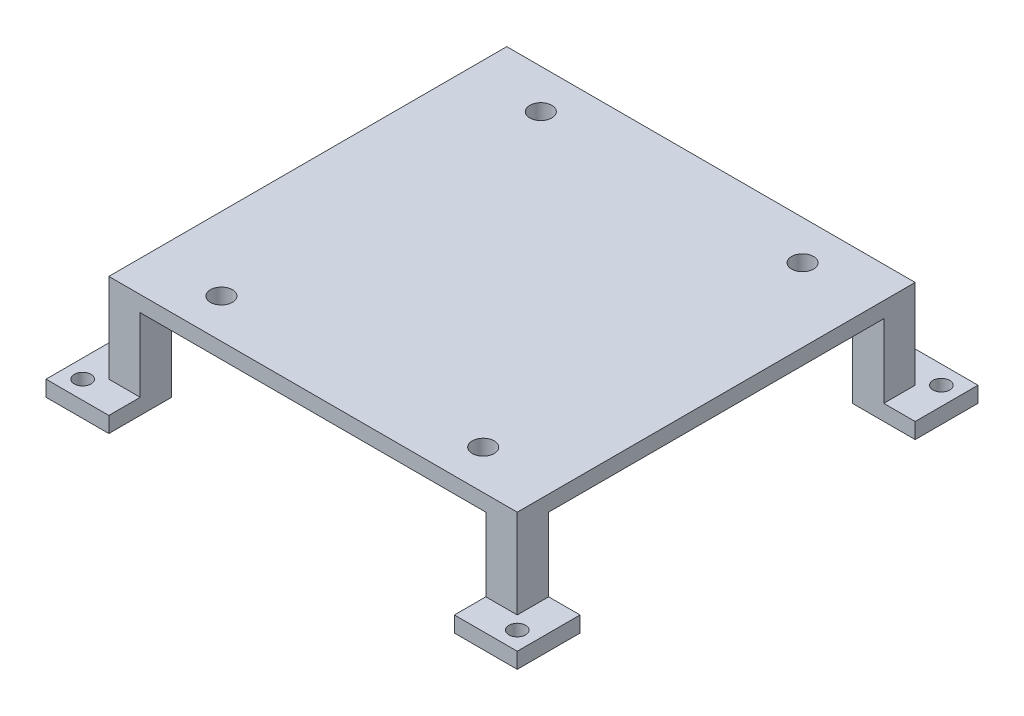
ISO-10303-21;
HEADER;
FILE_DESCRIPTION(('STEP AP214'),'2;1');
FILE_NAME('part.step','',(''),(''),'','','');
FILE_SCHEMA(('AUTOMOTIVE_DESIGN { 1 0 10303 214 1 1 1 1 }'));
ENDSEC;
DATA;
#1=APPLICATION_CONTEXT('core data for automotive mechanical design processes');
#2=APPLICATION_PROTOCOL_DEFINITION('international standard','automotive_design',2000,#1);
#3=PRODUCT_CONTEXT('',#1,'mechanical');
#4=PRODUCT('Part','Part','',(#3));
#5=PRODUCT_RELATED_PRODUCT_CATEGORY('part','',(#4));
#6=PRODUCT_DEFINITION_FORMATION('','',#4);
#7=PRODUCT_DEFINITION_CONTEXT('part definition',#1,'design');
#8=PRODUCT_DEFINITION('design','',#6,#7);
#9=PRODUCT_DEFINITION_SHAPE('','',#8);
#10=(LENGTH_UNIT() NAMED_UNIT(*) SI_UNIT(.MILLI.,.METRE.));
#11=(NAMED_UNIT(*) PLANE_ANGLE_UNIT() SI_UNIT($,.RADIAN.));
#12=(NAMED_UNIT(*) SI_UNIT($,.STERADIAN.) SOLID_ANGLE_UNIT());
#13=UNCERTAINTY_MEASURE_WITH_UNIT(LENGTH_MEASURE(1.E-05),#10,'distance_accuracy_value','');
#14=(GEOMETRIC_REPRESENTATION_CONTEXT(3) GLOBAL_UNCERTAINTY_ASSIGNED_CONTEXT((#13)) GLOBAL_UNIT_ASSIGNED_CONTEXT((#10,
#11,#12)) REPRESENTATION_CONTEXT('',''));
#15=CARTESIAN_POINT('',(0.,0.,0.));
#16=DIRECTION('',(0.,0.,1.));
#17=DIRECTION('',(1.,0.,0.));
#18=AXIS2_PLACEMENT_3D('',#15,#16,#17);
#19=CARTESIAN_POINT('',(0.,17.,0.));
#20=DIRECTION('',(0.,1.,0.));
#21=DIRECTION('',(0.,0.,1.));
#22=AXIS2_PLACEMENT_3D('',#19,#20,#21);
#23=PLANE('',#22);
#24=CARTESIAN_POINT('',(25.,17.,30.5));
#25=DIRECTION('',(0.,1.,0.));
#26=DIRECTION('',(0.,0.,1.));
#27=AXIS2_PLACEMENT_3D('',#24,#25,#26);
#28=CIRCLE('',#27,2.1);
#29=CARTESIAN_POINT('',(25.,17.,32.6));
#30=VERTEX_POINT('',#29);
#31=EDGE_CURVE('E519',#30,#30,#28,.F.);
#32=ORIENTED_EDGE('',*,*,#31,.F.);
#33=EDGE_LOOP('',(#32));
#34=FACE_BOUND('',#33,.T.);
#35=CARTESIAN_POINT('',(-25.,17.,-30.5));
#36=DIRECTION('',(0.,1.,0.));
#37=DIRECTION('',(0.,0.,1.));
#38=AXIS2_PLACEMENT_3D('',#35,#36,#37);
#39=CIRCLE('',#38,2.1);
#40=CARTESIAN_POINT('',(-25.,17.,-28.4));
#41=VERTEX_POINT('',#40);
#42=EDGE_CURVE('E527',#41,#41,#39,.F.);
#43=ORIENTED_EDGE('',*,*,#42,.F.);
#44=EDGE_LOOP('',(#43));
#45=FACE_BOUND('',#44,.T.);
#46=CARTESIAN_POINT('',(-25.,17.,30.5));
#47=DIRECTION('',(0.,1.,0.));
#48=DIRECTION('',(0.,0.,1.));
#49=AXIS2_PLACEMENT_3D('',#46,#47,#48);
#50=CIRCLE('',#49,2.1);
#51=CARTESIAN_POINT('',(-25.,17.,32.6));
#52=VERTEX_POINT('',#51);
#53=EDGE_CURVE('E520',#52,#52,#50,.F.);
#54=ORIENTED_EDGE('',*,*,#53,.F.);
#55=EDGE_LOOP('',(#54));
#56=FACE_BOUND('',#55,.T.);
#57=CARTESIAN_POINT('',(25.,17.,-30.5));
#58=DIRECTION('',(0.,1.,0.));
#59=DIRECTION('',(0.,0.,1.));
#60=AXIS2_PLACEMENT_3D('',#57,#58,#59);
#61=CIRCLE('',#60,2.1);
#62=CARTESIAN_POINT('',(25.,17.,-28.4));
#63=VERTEX_POINT('',#62);
#64=EDGE_CURVE('E506',#63,#63,#61,.F.);
#65=ORIENTED_EDGE('',*,*,#64,.F.);
#66=EDGE_LOOP('',(#65));
#67=FACE_BOUND('',#66,.T.);
#68=DIRECTION('',(-1.,0.,0.));
#69=VECTOR('',#68,1.);
#70=CARTESIAN_POINT('',(33.,17.,32.));
#71=LINE('',#70,#69);
#72=CARTESIAN_POINT('',(39.,17.,32.));
#73=VERTEX_POINT('',#72);
#74=CARTESIAN_POINT('',(33.,17.,32.));
#75=VERTEX_POINT('',#74);
#76=EDGE_CURVE('E62',#73,#75,#71,.T.);
#77=ORIENTED_EDGE('',*,*,#76,.T.);
#78=DIRECTION('',(0.,0.,1.));
#79=VECTOR('',#78,1.);
#80=CARTESIAN_POINT('',(33.,17.,38.));
#81=LINE('',#80,#79);
#82=CARTESIAN_POINT('',(33.,17.,38.));
#83=VERTEX_POINT('',#82);
#84=EDGE_CURVE('E239',#75,#83,#81,.T.);
#85=ORIENTED_EDGE('',*,*,#84,.T.);
#86=DIRECTION('',(1.,0.,0.));
#87=VECTOR('',#86,1.);
#88=CARTESIAN_POINT('',(-39.,17.,38.));
#89=LINE('',#88,#87);
#90=CARTESIAN_POINT('',(-33.,17.,38.));
#91=VERTEX_POINT('',#90);
#92=EDGE_CURVE('E250',#91,#83,#89,.T.);
#93=ORIENTED_EDGE('',*,*,#92,.F.);
#94=DIRECTION('',(0.,0.,-1.));
#95=VECTOR('',#94,1.);
#96=CARTESIAN_POINT('',(-33.,17.,32.));
#97=LINE('',#96,#95);
#98=CARTESIAN_POINT('',(-33.,17.,32.));
#99=VERTEX_POINT('',#98);
#100=EDGE_CURVE('E70',#91,#99,#97,.T.);
#101=ORIENTED_EDGE('',*,*,#100,.T.);
#102=DIRECTION('',(-1.,0.,0.));
#103=VECTOR('',#102,1.);
#104=CARTESIAN_POINT('',(-39.,17.,32.));
#105=LINE('',#104,#103);
#106=CARTESIAN_POINT('',(-39.,17.,32.));
#107=VERTEX_POINT('',#106);
#108=EDGE_CURVE('E406',#99,#107,#105,.T.);
#109=ORIENTED_EDGE('',*,*,#108,.T.);
#110=DIRECTION('',(0.,0.,1.));
#111=VECTOR('',#110,1.);
#112=CARTESIAN_POINT('',(-39.,17.,-38.));
#113=LINE('',#112,#111);
#114=CARTESIAN_POINT('',(-39.,17.,-32.));
#115=VERTEX_POINT('',#114);
#116=EDGE_CURVE('E258',#115,#107,#113,.T.);
#117=ORIENTED_EDGE('',*,*,#116,.F.);
#118=DIRECTION('',(1.,0.,0.));
#119=VECTOR('',#118,1.);
#120=CARTESIAN_POINT('',(-33.,17.,-32.));
#121=LINE('',#120,#119);
#122=CARTESIAN_POINT('',(-33.,17.,-32.));
#123=VERTEX_POINT('',#122);
#124=EDGE_CURVE('E280',#115,#123,#121,.T.);
#125=ORIENTED_EDGE('',*,*,#124,.T.);
#126=DIRECTION('',(0.,0.,-1.));
#127=VECTOR('',#126,1.);
#128=CARTESIAN_POINT('',(-33.,17.,-38.));
#129=LINE('',#128,#127);
#130=CARTESIAN_POINT('',(-33.,17.,-38.));
#131=VERTEX_POINT('',#130);
#132=EDGE_CURVE('E277',#123,#131,#129,.T.);
#133=ORIENTED_EDGE('',*,*,#132,.T.);
#134=DIRECTION('',(-1.,0.,0.));
#135=VECTOR('',#134,1.);
#136=CARTESIAN_POINT('',(-39.,17.,-38.));
#137=LINE('',#136,#135);
#138=CARTESIAN_POINT('',(33.,17.,-38.));
#139=VERTEX_POINT('',#138);
#140=EDGE_CURVE('E260',#139,#131,#137,.T.);
#141=ORIENTED_EDGE('',*,*,#140,.F.);
#142=DIRECTION('',(0.,0.,1.));
#143=VECTOR('',#142,1.);
#144=CARTESIAN_POINT('',(33.,17.,-38.));
#145=LINE('',#144,#143);
#146=CARTESIAN_POINT('',(33.,17.,-32.));
#147=VERTEX_POINT('',#146);
#148=EDGE_CURVE('E352',#139,#147,#145,.T.);
#149=ORIENTED_EDGE('',*,*,#148,.T.);
#150=DIRECTION('',(1.,0.,0.));
#151=VECTOR('',#150,1.);
#152=CARTESIAN_POINT('',(33.,17.,-32.));
#153=LINE('',#152,#151);
#154=CARTESIAN_POINT('',(39.,17.,-32.));
#155=VERTEX_POINT('',#154);
#156=EDGE_CURVE('E448',#147,#155,#153,.T.);
#157=ORIENTED_EDGE('',*,*,#156,.T.);
#158=DIRECTION('',(0.,0.,-1.));
#159=VECTOR('',#158,1.);
#160=CARTESIAN_POINT('',(39.,17.,-38.));
#161=LINE('',#160,#159);
#162=EDGE_CURVE('E257',#73,#155,#161,.T.);
#163=ORIENTED_EDGE('',*,*,#162,.F.);
#164=EDGE_LOOP('',(#77,#85,#93,#101,#109,#117,#125,#133,#141,#149,#157,#163));
#165=FACE_BOUND('',#164,.T.);
#166=ADVANCED_FACE('F47',(#34,#45,#56,#67,#165),#23,.F.);
#167=CARTESIAN_POINT('',(-45.,3.,-44.));
#168=DIRECTION('',(1.,0.,0.));
#169=DIRECTION('',(0.,0.,-1.));
#170=AXIS2_PLACEMENT_3D('',#167,#168,#169);
#171=PLANE('',#170);
#172=DIRECTION('',(0.,0.,1.));
#173=VECTOR('',#172,1.);
#174=CARTESIAN_POINT('',(-45.,0.,-44.));
#175=LINE('',#174,#173);
#176=CARTESIAN_POINT('',(-45.,0.,-44.));
#177=VERTEX_POINT('',#176);
#178=CARTESIAN_POINT('',(-45.,0.,-32.));
#179=VERTEX_POINT('',#178);
#180=EDGE_CURVE('E297',#177,#179,#175,.T.);
#181=ORIENTED_EDGE('',*,*,#180,.T.);
#182=DIRECTION('',(0.,-1.,0.));
#183=VECTOR('',#182,1.);
#184=CARTESIAN_POINT('',(-45.,3.,-32.));
#185=LINE('',#184,#183);
#186=CARTESIAN_POINT('',(-45.,3.,-32.));
#187=VERTEX_POINT('',#186);
#188=EDGE_CURVE('E13',#187,#179,#185,.T.);
#189=ORIENTED_EDGE('',*,*,#188,.F.);
#190=DIRECTION('',(0.,0.,1.));
#191=VECTOR('',#190,1.);
#192=CARTESIAN_POINT('',(-45.,3.,-44.));
#193=LINE('',#192,#191);
#194=CARTESIAN_POINT('',(-45.,3.,-44.));
#195=VERTEX_POINT('',#194);
#196=EDGE_CURVE('E298',#195,#187,#193,.T.);
#197=ORIENTED_EDGE('',*,*,#196,.F.);
#198=DIRECTION('',(0.,-1.,0.));
#199=VECTOR('',#198,1.);
#200=CARTESIAN_POINT('',(-45.,3.,-44.));
#201=LINE('',#200,#199);
#202=EDGE_CURVE('E308',#195,#177,#201,.T.);
#203=ORIENTED_EDGE('',*,*,#202,.T.);
#204=EDGE_LOOP('',(#181,#189,#197,#203));
#205=FACE_BOUND('',#204,.T.);
#206=ADVANCED_FACE('F49',(#205),#171,.F.);
#207=CARTESIAN_POINT('',(-45.,3.,-32.));
#208=DIRECTION('',(0.,0.,-1.));
#209=DIRECTION('',(-1.,0.,0.));
#210=AXIS2_PLACEMENT_3D('',#207,#208,#209);
#211=PLANE('',#210);
#212=DIRECTION('',(1.,0.,0.));
#213=VECTOR('',#212,1.);
#214=CARTESIAN_POINT('',(-45.,0.,-32.));
#215=LINE('',#214,#213);
#216=CARTESIAN_POINT('',(-33.,0.,-32.));
#217=VERTEX_POINT('',#216);
#218=EDGE_CURVE('E311',#179,#217,#215,.T.);
#219=ORIENTED_EDGE('',*,*,#218,.T.);
#220=DIRECTION('',(0.,-1.,0.));
#221=VECTOR('',#220,1.);
#222=CARTESIAN_POINT('',(-33.,3.,-32.));
#223=LINE('',#222,#221);
#224=EDGE_CURVE('E55',#123,#217,#223,.T.);
#225=ORIENTED_EDGE('',*,*,#224,.F.);
#226=ORIENTED_EDGE('',*,*,#124,.F.);
#227=DIRECTION('',(0.,-1.,0.));
#228=VECTOR('',#227,1.);
#229=CARTESIAN_POINT('',(-39.,17.,-32.));
#230=LINE('',#229,#228);
#231=CARTESIAN_POINT('',(-39.,3.,-32.));
#232=VERTEX_POINT('',#231);
#233=EDGE_CURVE('E284',#115,#232,#230,.T.);
#234=ORIENTED_EDGE('',*,*,#233,.T.);
#235=DIRECTION('',(1.,0.,0.));
#236=VECTOR('',#235,1.);
#237=CARTESIAN_POINT('',(-45.,3.,-32.));
#238=LINE('',#237,#236);
#239=EDGE_CURVE('E301',#187,#232,#238,.T.);
#240=ORIENTED_EDGE('',*,*,#239,.F.);
#241=ORIENTED_EDGE('',*,*,#188,.T.);
#242=EDGE_LOOP('',(#219,#225,#226,#234,#240,#241));
#243=FACE_BOUND('',#242,.T.);
#244=ADVANCED_FACE('F355',(#243),#211,.F.);
#245=CARTESIAN_POINT('',(-33.,3.,-44.));
#246=DIRECTION('',(-1.,0.,0.));
#247=DIRECTION('',(0.,0.,1.));
#248=AXIS2_PLACEMENT_3D('',#245,#246,#247);
#249=PLANE('',#248);
#250=DIRECTION('',(0.,0.,-1.));
#251=VECTOR('',#250,1.);
#252=CARTESIAN_POINT('',(-33.,0.,-44.));
#253=LINE('',#252,#251);
#254=CARTESIAN_POINT('',(-33.,0.,-44.));
#255=VERTEX_POINT('',#254);
#256=EDGE_CURVE('E313',#217,#255,#253,.T.);
#257=ORIENTED_EDGE('',*,*,#256,.T.);
#258=DIRECTION('',(0.,-1.,0.));
#259=VECTOR('',#258,1.);
#260=CARTESIAN_POINT('',(-33.,3.,-44.));
#261=LINE('',#260,#259);
#262=CARTESIAN_POINT('',(-33.,3.,-44.));
#263=VERTEX_POINT('',#262);
#264=EDGE_CURVE('E318',#263,#255,#261,.T.);
#265=ORIENTED_EDGE('',*,*,#264,.F.);
#266=DIRECTION('',(0.,0.,-1.));
#267=VECTOR('',#266,1.);
#268=CARTESIAN_POINT('',(-33.,3.,-44.));
#269=LINE('',#268,#267);
#270=CARTESIAN_POINT('',(-33.,3.,-38.));
#271=VERTEX_POINT('',#270);
#272=EDGE_CURVE('E304',#271,#263,#269,.T.);
#273=ORIENTED_EDGE('',*,*,#272,.F.);
#274=DIRECTION('',(0.,-1.,0.));
#275=VECTOR('',#274,1.);
#276=CARTESIAN_POINT('',(-33.,17.,-38.));
#277=LINE('',#276,#275);
#278=EDGE_CURVE('E294',#131,#271,#277,.T.);
#279=ORIENTED_EDGE('',*,*,#278,.F.);
#280=ORIENTED_EDGE('',*,*,#132,.F.);
#281=ORIENTED_EDGE('',*,*,#224,.T.);
#282=EDGE_LOOP('',(#257,#265,#273,#279,#280,#281));
#283=FACE_BOUND('',#282,.T.);
#284=ADVANCED_FACE('F324',(#283),#249,.F.);
#285=CARTESIAN_POINT('',(-45.,3.,-44.));
#286=DIRECTION('',(0.,0.,1.));
#287=DIRECTION('',(1.,0.,0.));
#288=AXIS2_PLACEMENT_3D('',#285,#286,#287);
#289=PLANE('',#288);
#290=DIRECTION('',(-1.,0.,0.));
#291=VECTOR('',#290,1.);
#292=CARTESIAN_POINT('',(-45.,0.,-44.));
#293=LINE('',#292,#291);
#294=EDGE_CURVE('E302',#255,#177,#293,.T.);
#295=ORIENTED_EDGE('',*,*,#294,.T.);
#296=ORIENTED_EDGE('',*,*,#202,.F.);
#297=DIRECTION('',(-1.,0.,0.));
#298=VECTOR('',#297,1.);
#299=CARTESIAN_POINT('',(-45.,3.,-44.));
#300=LINE('',#299,#298);
#301=EDGE_CURVE('E306',#263,#195,#300,.T.);
#302=ORIENTED_EDGE('',*,*,#301,.F.);
#303=ORIENTED_EDGE('',*,*,#264,.T.);
#304=EDGE_LOOP('',(#295,#296,#302,#303));
#305=FACE_BOUND('',#304,.T.);
#306=ADVANCED_FACE('F335',(#305),#289,.F.);
#307=CARTESIAN_POINT('',(0.,3.,0.));
#308=DIRECTION('',(0.,1.,0.));
#309=DIRECTION('',(0.,0.,1.));
#310=AXIS2_PLACEMENT_3D('',#307,#308,#309);
#311=PLANE('',#310);
#312=CARTESIAN_POINT('',(-41.5,3.,-40.5));
#313=DIRECTION('',(0.,1.,0.));
#314=DIRECTION('',(0.,0.,-1.));
#315=AXIS2_PLACEMENT_3D('',#312,#313,#314);
#316=CIRCLE('',#315,1.6);
#317=CARTESIAN_POINT('',(-41.5,3.,-42.1));
#318=VERTEX_POINT('',#317);
#319=EDGE_CURVE('E498',#318,#318,#316,.T.);
#320=ORIENTED_EDGE('',*,*,#319,.F.);
#321=EDGE_LOOP('',(#320));
#322=FACE_BOUND('',#321,.T.);
#323=DIRECTION('',(0.,0.,1.));
#324=VECTOR('',#323,1.);
#325=CARTESIAN_POINT('',(-39.,3.,-38.));
#326=LINE('',#325,#324);
#327=CARTESIAN_POINT('',(-39.,3.,-38.));
#328=VERTEX_POINT('',#327);
#329=EDGE_CURVE('E281',#328,#232,#326,.T.);
#330=ORIENTED_EDGE('',*,*,#329,.F.);
#331=DIRECTION('',(-1.,0.,0.));
#332=VECTOR('',#331,1.);
#333=CARTESIAN_POINT('',(-33.,3.,-38.));
#334=LINE('',#333,#332);
#335=EDGE_CURVE('E276',#271,#328,#334,.T.);
#336=ORIENTED_EDGE('',*,*,#335,.F.);
#337=ORIENTED_EDGE('',*,*,#272,.T.);
#338=ORIENTED_EDGE('',*,*,#301,.T.);
#339=ORIENTED_EDGE('',*,*,#196,.T.);
#340=ORIENTED_EDGE('',*,*,#239,.T.);
#341=EDGE_LOOP('',(#330,#336,#337,#338,#339,#340));
#342=FACE_BOUND('',#341,.T.);
#343=ADVANCED_FACE('F341',(#322,#342),#311,.T.);
#344=CARTESIAN_POINT('',(0.,0.,0.));
#345=DIRECTION('',(0.,1.,0.));
#346=DIRECTION('',(0.,0.,1.));
#347=AXIS2_PLACEMENT_3D('',#344,#345,#346);
#348=PLANE('',#347);
#349=CARTESIAN_POINT('',(-41.5,0.,-40.5));
#350=DIRECTION('',(0.,1.,0.));
#351=DIRECTION('',(0.,0.,1.));
#352=AXIS2_PLACEMENT_3D('',#349,#350,#351);
#353=CIRCLE('',#352,1.6);
#354=CARTESIAN_POINT('',(-41.5,0.,-38.9));
#355=VERTEX_POINT('',#354);
#356=EDGE_CURVE('E493',#355,#355,#353,.F.);
#357=ORIENTED_EDGE('',*,*,#356,.F.);
#358=EDGE_LOOP('',(#357));
#359=FACE_BOUND('',#358,.T.);
#360=ORIENTED_EDGE('',*,*,#180,.F.);
#361=ORIENTED_EDGE('',*,*,#294,.F.);
#362=ORIENTED_EDGE('',*,*,#256,.F.);
#363=ORIENTED_EDGE('',*,*,#218,.F.);
#364=EDGE_LOOP('',(#360,#361,#362,#363));
#365=FACE_BOUND('',#364,.T.);
#366=ADVANCED_FACE('F332',(#359,#365),#348,.F.);
#367=CARTESIAN_POINT('',(-33.,17.,-38.));
#368=DIRECTION('',(0.,0.,1.));
#369=DIRECTION('',(1.,0.,0.));
#370=AXIS2_PLACEMENT_3D('',#367,#368,#369);
#371=PLANE('',#370);
#372=ORIENTED_EDGE('',*,*,#335,.T.);
#373=DIRECTION('',(0.,-1.,0.));
#374=VECTOR('',#373,1.);
#375=CARTESIAN_POINT('',(-39.,17.,-38.));
#376=LINE('',#375,#374);
#377=CARTESIAN_POINT('',(-39.,20.,-38.));
#378=VERTEX_POINT('',#377);
#379=EDGE_CURVE('E291',#378,#328,#376,.T.);
#380=ORIENTED_EDGE('',*,*,#379,.F.);
#381=DIRECTION('',(-1.,0.,0.));
#382=VECTOR('',#381,1.);
#383=CARTESIAN_POINT('',(-39.,20.,-38.));
#384=LINE('',#383,#382);
#385=CARTESIAN_POINT('',(39.,20.,-38.));
#386=VERTEX_POINT('',#385);
#387=EDGE_CURVE('E272',#386,#378,#384,.T.);
#388=ORIENTED_EDGE('',*,*,#387,.F.);
#389=DIRECTION('',(0.,-1.,0.));
#390=VECTOR('',#389,1.);
#391=CARTESIAN_POINT('',(39.,20.,-38.));
#392=LINE('',#391,#390);
#393=CARTESIAN_POINT('',(39.,3.,-38.));
#394=VERTEX_POINT('',#393);
#395=EDGE_CURVE('E269',#386,#394,#392,.T.);
#396=ORIENTED_EDGE('',*,*,#395,.T.);
#397=DIRECTION('',(-1.,0.,0.));
#398=VECTOR('',#397,1.);
#399=CARTESIAN_POINT('',(33.,3.,-38.));
#400=LINE('',#399,#398);
#401=CARTESIAN_POINT('',(33.,3.,-38.));
#402=VERTEX_POINT('',#401);
#403=EDGE_CURVE('E449',#394,#402,#400,.T.);
#404=ORIENTED_EDGE('',*,*,#403,.T.);
#405=DIRECTION('',(0.,-1.,0.));
#406=VECTOR('',#405,1.);
#407=CARTESIAN_POINT('',(33.,17.,-38.));
#408=LINE('',#407,#406);
#409=EDGE_CURVE('E348',#139,#402,#408,.T.);
#410=ORIENTED_EDGE('',*,*,#409,.F.);
#411=ORIENTED_EDGE('',*,*,#140,.T.);
#412=ORIENTED_EDGE('',*,*,#278,.T.);
#413=EDGE_LOOP('',(#372,#380,#388,#396,#404,#410,#411,#412));
#414=FACE_BOUND('',#413,.T.);
#415=ADVANCED_FACE('F344',(#414),#371,.F.);
#416=CARTESIAN_POINT('',(-39.,17.,-38.));
#417=DIRECTION('',(1.,0.,0.));
#418=DIRECTION('',(0.,0.,-1.));
#419=AXIS2_PLACEMENT_3D('',#416,#417,#418);
#420=PLANE('',#419);
#421=ORIENTED_EDGE('',*,*,#329,.T.);
#422=ORIENTED_EDGE('',*,*,#233,.F.);
#423=ORIENTED_EDGE('',*,*,#116,.T.);
#424=DIRECTION('',(0.,-1.,0.));
#425=VECTOR('',#424,1.);
#426=CARTESIAN_POINT('',(-39.,17.,32.));
#427=LINE('',#426,#425);
#428=CARTESIAN_POINT('',(-39.,3.,32.));
#429=VERTEX_POINT('',#428);
#430=EDGE_CURVE('E404',#107,#429,#427,.T.);
#431=ORIENTED_EDGE('',*,*,#430,.T.);
#432=DIRECTION('',(0.,0.,1.));
#433=VECTOR('',#432,1.);
#434=CARTESIAN_POINT('',(-39.,3.,32.));
#435=LINE('',#434,#433);
#436=CARTESIAN_POINT('',(-39.,3.,38.));
#437=VERTEX_POINT('',#436);
#438=EDGE_CURVE('E409',#429,#437,#435,.T.);
#439=ORIENTED_EDGE('',*,*,#438,.T.);
#440=DIRECTION('',(0.,-1.,0.));
#441=VECTOR('',#440,1.);
#442=CARTESIAN_POINT('',(-39.,20.,38.));
#443=LINE('',#442,#441);
#444=CARTESIAN_POINT('',(-39.,20.,38.));
#445=VERTEX_POINT('',#444);
#446=EDGE_CURVE('E274',#445,#437,#443,.T.);
#447=ORIENTED_EDGE('',*,*,#446,.F.);
#448=DIRECTION('',(0.,0.,1.));
#449=VECTOR('',#448,1.);
#450=CARTESIAN_POINT('',(-39.,20.,-38.));
#451=LINE('',#450,#449);
#452=EDGE_CURVE('E268',#378,#445,#451,.T.);
#453=ORIENTED_EDGE('',*,*,#452,.F.);
#454=ORIENTED_EDGE('',*,*,#379,.T.);
#455=EDGE_LOOP('',(#421,#422,#423,#431,#439,#447,#453,#454));
#456=FACE_BOUND('',#455,.T.);
#457=ADVANCED_FACE('F357',(#456),#420,.F.);
#458=CARTESIAN_POINT('',(-39.,20.,38.));
#459=DIRECTION('',(0.,0.,-1.));
#460=DIRECTION('',(-1.,0.,0.));
#461=AXIS2_PLACEMENT_3D('',#458,#459,#460);
#462=PLANE('',#461);
#463=ORIENTED_EDGE('',*,*,#446,.T.);
#464=DIRECTION('',(1.,0.,0.));
#465=VECTOR('',#464,1.);
#466=CARTESIAN_POINT('',(-39.,3.,38.));
#467=LINE('',#466,#465);
#468=CARTESIAN_POINT('',(-33.,3.,38.));
#469=VERTEX_POINT('',#468);
#470=EDGE_CURVE('E407',#437,#469,#467,.T.);
#471=ORIENTED_EDGE('',*,*,#470,.T.);
#472=DIRECTION('',(0.,-1.,0.));
#473=VECTOR('',#472,1.);
#474=CARTESIAN_POINT('',(-33.,17.,38.));
#475=LINE('',#474,#473);
#476=EDGE_CURVE('E256',#91,#469,#475,.T.);
#477=ORIENTED_EDGE('',*,*,#476,.F.);
#478=ORIENTED_EDGE('',*,*,#92,.T.);
#479=DIRECTION('',(0.,-1.,0.));
#480=VECTOR('',#479,1.);
#481=CARTESIAN_POINT('',(33.,17.,38.));
#482=LINE('',#481,#480);
#483=CARTESIAN_POINT('',(33.,3.,38.));
#484=VERTEX_POINT('',#483);
#485=EDGE_CURVE('E235',#83,#484,#482,.T.);
#486=ORIENTED_EDGE('',*,*,#485,.T.);
#487=DIRECTION('',(1.,0.,0.));
#488=VECTOR('',#487,1.);
#489=CARTESIAN_POINT('',(33.,3.,38.));
#490=LINE('',#489,#488);
#491=CARTESIAN_POINT('',(39.,3.,38.));
#492=VERTEX_POINT('',#491);
#493=EDGE_CURVE('E486',#484,#492,#490,.T.);
#494=ORIENTED_EDGE('',*,*,#493,.T.);
#495=DIRECTION('',(0.,-1.,0.));
#496=VECTOR('',#495,1.);
#497=CARTESIAN_POINT('',(39.,20.,38.));
#498=LINE('',#497,#496);
#499=CARTESIAN_POINT('',(39.,20.,38.));
#500=VERTEX_POINT('',#499);
#501=EDGE_CURVE('E271',#500,#492,#498,.T.);
#502=ORIENTED_EDGE('',*,*,#501,.F.);
#503=DIRECTION('',(1.,0.,0.));
#504=VECTOR('',#503,1.);
#505=CARTESIAN_POINT('',(-39.,20.,38.));
#506=LINE('',#505,#504);
#507=EDGE_CURVE('E369',#445,#500,#506,.T.);
#508=ORIENTED_EDGE('',*,*,#507,.F.);
#509=EDGE_LOOP('',(#463,#471,#477,#478,#486,#494,#502,#508));
#510=FACE_BOUND('',#509,.T.);
#511=ADVANCED_FACE('F254',(#510),#462,.F.);
#512=CARTESIAN_POINT('',(39.,20.,-38.));
#513=DIRECTION('',(-1.,0.,0.));
#514=DIRECTION('',(0.,0.,1.));
#515=AXIS2_PLACEMENT_3D('',#512,#513,#514);
#516=PLANE('',#515);
#517=ORIENTED_EDGE('',*,*,#501,.T.);
#518=DIRECTION('',(0.,0.,-1.));
#519=VECTOR('',#518,1.);
#520=CARTESIAN_POINT('',(39.,3.,38.));
#521=LINE('',#520,#519);
#522=CARTESIAN_POINT('',(39.,3.,32.));
#523=VERTEX_POINT('',#522);
#524=EDGE_CURVE('E252',#492,#523,#521,.T.);
#525=ORIENTED_EDGE('',*,*,#524,.T.);
#526=DIRECTION('',(0.,-1.,0.));
#527=VECTOR('',#526,1.);
#528=CARTESIAN_POINT('',(39.,17.,32.));
#529=LINE('',#528,#527);
#530=EDGE_CURVE('E246',#73,#523,#529,.T.);
#531=ORIENTED_EDGE('',*,*,#530,.F.);
#532=ORIENTED_EDGE('',*,*,#162,.T.);
#533=DIRECTION('',(0.,-1.,0.));
#534=VECTOR('',#533,1.);
#535=CARTESIAN_POINT('',(39.,17.,-32.));
#536=LINE('',#535,#534);
#537=CARTESIAN_POINT('',(39.,3.,-32.));
#538=VERTEX_POINT('',#537);
#539=EDGE_CURVE('E437',#155,#538,#536,.T.);
#540=ORIENTED_EDGE('',*,*,#539,.T.);
#541=DIRECTION('',(0.,0.,-1.));
#542=VECTOR('',#541,1.);
#543=CARTESIAN_POINT('',(39.,3.,-38.));
#544=LINE('',#543,#542);
#545=EDGE_CURVE('E451',#538,#394,#544,.T.);
#546=ORIENTED_EDGE('',*,*,#545,.T.);
#547=ORIENTED_EDGE('',*,*,#395,.F.);
#548=DIRECTION('',(0.,0.,-1.));
#549=VECTOR('',#548,1.);
#550=CARTESIAN_POINT('',(39.,20.,-38.));
#551=LINE('',#550,#549);
#552=EDGE_CURVE('E367',#500,#386,#551,.T.);
#553=ORIENTED_EDGE('',*,*,#552,.F.);
#554=EDGE_LOOP('',(#517,#525,#531,#532,#540,#546,#547,#553));
#555=FACE_BOUND('',#554,.T.);
#556=ADVANCED_FACE('F544',(#555),#516,.F.);
#557=CARTESIAN_POINT('',(0.,20.,0.));
#558=DIRECTION('',(0.,1.,0.));
#559=DIRECTION('',(0.,0.,1.));
#560=AXIS2_PLACEMENT_3D('',#557,#558,#559);
#561=PLANE('',#560);
#562=CARTESIAN_POINT('',(25.,20.,30.5));
#563=DIRECTION('',(0.,1.,0.));
#564=DIRECTION('',(0.,0.,-1.));
#565=AXIS2_PLACEMENT_3D('',#562,#563,#564);
#566=CIRCLE('',#565,2.1);
#567=CARTESIAN_POINT('',(25.,20.,28.4));
#568=VERTEX_POINT('',#567);
#569=EDGE_CURVE('E530',#568,#568,#566,.T.);
#570=ORIENTED_EDGE('',*,*,#569,.F.);
#571=EDGE_LOOP('',(#570));
#572=FACE_BOUND('',#571,.T.);
#573=CARTESIAN_POINT('',(-25.,20.,-30.5));
#574=DIRECTION('',(0.,1.,0.));
#575=DIRECTION('',(0.,0.,-1.));
#576=AXIS2_PLACEMENT_3D('',#573,#574,#575);
#577=CIRCLE('',#576,2.1);
#578=CARTESIAN_POINT('',(-25.,20.,-32.6));
#579=VERTEX_POINT('',#578);
#580=EDGE_CURVE('E523',#579,#579,#577,.T.);
#581=ORIENTED_EDGE('',*,*,#580,.F.);
#582=EDGE_LOOP('',(#581));
#583=FACE_BOUND('',#582,.T.);
#584=CARTESIAN_POINT('',(-25.,20.,30.5));
#585=DIRECTION('',(0.,1.,0.));
#586=DIRECTION('',(0.,0.,1.));
#587=AXIS2_PLACEMENT_3D('',#584,#585,#586);
#588=CIRCLE('',#587,2.1);
#589=CARTESIAN_POINT('',(-25.,20.,32.6));
#590=VERTEX_POINT('',#589);
#591=EDGE_CURVE('E524',#590,#590,#588,.T.);
#592=ORIENTED_EDGE('',*,*,#591,.F.);
#593=EDGE_LOOP('',(#592));
#594=FACE_BOUND('',#593,.T.);
#595=CARTESIAN_POINT('',(25.,20.,-30.5));
#596=DIRECTION('',(0.,1.,0.));
#597=DIRECTION('',(0.,0.,1.));
#598=AXIS2_PLACEMENT_3D('',#595,#596,#597);
#599=CIRCLE('',#598,2.1);
#600=CARTESIAN_POINT('',(25.,20.,-28.4));
#601=VERTEX_POINT('',#600);
#602=EDGE_CURVE('E516',#601,#601,#599,.T.);
#603=ORIENTED_EDGE('',*,*,#602,.F.);
#604=EDGE_LOOP('',(#603));
#605=FACE_BOUND('',#604,.T.);
#606=ORIENTED_EDGE('',*,*,#452,.T.);
#607=ORIENTED_EDGE('',*,*,#507,.T.);
#608=ORIENTED_EDGE('',*,*,#552,.T.);
#609=ORIENTED_EDGE('',*,*,#387,.T.);
#610=EDGE_LOOP('',(#606,#607,#608,#609));
#611=FACE_BOUND('',#610,.T.);
#612=ADVANCED_FACE('F365',(#572,#583,#594,#605,#611),#561,.T.);
#613=CARTESIAN_POINT('',(0.,3.,0.));
#614=DIRECTION('',(0.,-1.,0.));
#615=DIRECTION('',(0.,0.,-1.));
#616=AXIS2_PLACEMENT_3D('',#613,#614,#615);
#617=PLANE('',#616);
#618=CARTESIAN_POINT('',(-41.5,3.,40.5));
#619=DIRECTION('',(0.,1.,0.));
#620=DIRECTION('',(0.,0.,1.));
#621=AXIS2_PLACEMENT_3D('',#618,#619,#620);
#622=CIRCLE('',#621,1.6);
#623=CARTESIAN_POINT('',(-41.5,3.,42.1));
#624=VERTEX_POINT('',#623);
#625=EDGE_CURVE('E501',#624,#624,#622,.T.);
#626=ORIENTED_EDGE('',*,*,#625,.F.);
#627=EDGE_LOOP('',(#626));
#628=FACE_BOUND('',#627,.T.);
#629=ORIENTED_EDGE('',*,*,#438,.F.);
#630=DIRECTION('',(-1.,0.,0.));
#631=VECTOR('',#630,1.);
#632=CARTESIAN_POINT('',(-45.,3.,32.));
#633=LINE('',#632,#631);
#634=CARTESIAN_POINT('',(-45.,3.,32.));
#635=VERTEX_POINT('',#634);
#636=EDGE_CURVE('E385',#429,#635,#633,.T.);
#637=ORIENTED_EDGE('',*,*,#636,.T.);
#638=DIRECTION('',(0.,0.,1.));
#639=VECTOR('',#638,1.);
#640=CARTESIAN_POINT('',(-45.,3.,44.));
#641=LINE('',#640,#639);
#642=CARTESIAN_POINT('',(-45.,3.,44.));
#643=VERTEX_POINT('',#642);
#644=EDGE_CURVE('E388',#635,#643,#641,.T.);
#645=ORIENTED_EDGE('',*,*,#644,.T.);
#646=DIRECTION('',(1.,0.,0.));
#647=VECTOR('',#646,1.);
#648=CARTESIAN_POINT('',(-45.,3.,44.));
#649=LINE('',#648,#647);
#650=CARTESIAN_POINT('',(-33.,3.,44.));
#651=VERTEX_POINT('',#650);
#652=EDGE_CURVE('E399',#643,#651,#649,.T.);
#653=ORIENTED_EDGE('',*,*,#652,.T.);
#654=DIRECTION('',(0.,0.,-1.));
#655=VECTOR('',#654,1.);
#656=CARTESIAN_POINT('',(-33.,3.,44.));
#657=LINE('',#656,#655);
#658=EDGE_CURVE('E397',#651,#469,#657,.T.);
#659=ORIENTED_EDGE('',*,*,#658,.T.);
#660=ORIENTED_EDGE('',*,*,#470,.F.);
#661=EDGE_LOOP('',(#629,#637,#645,#653,#659,#660));
#662=FACE_BOUND('',#661,.T.);
#663=ADVANCED_FACE('F543',(#628,#662),#617,.F.);
#664=CARTESIAN_POINT('',(-45.,3.,44.));
#665=DIRECTION('',(1.,0.,0.));
#666=DIRECTION('',(0.,0.,-1.));
#667=AXIS2_PLACEMENT_3D('',#664,#665,#666);
#668=PLANE('',#667);
#669=DIRECTION('',(0.,0.,1.));
#670=VECTOR('',#669,1.);
#671=CARTESIAN_POINT('',(-45.,0.,44.));
#672=LINE('',#671,#670);
#673=CARTESIAN_POINT('',(-45.,0.,32.));
#674=VERTEX_POINT('',#673);
#675=CARTESIAN_POINT('',(-45.,0.,44.));
#676=VERTEX_POINT('',#675);
#677=EDGE_CURVE('E393',#674,#676,#672,.T.);
#678=ORIENTED_EDGE('',*,*,#677,.T.);
#679=DIRECTION('',(0.,-1.,0.));
#680=VECTOR('',#679,1.);
#681=CARTESIAN_POINT('',(-45.,3.,44.));
#682=LINE('',#681,#680);
#683=EDGE_CURVE('E263',#643,#676,#682,.T.);
#684=ORIENTED_EDGE('',*,*,#683,.F.);
#685=ORIENTED_EDGE('',*,*,#644,.F.);
#686=DIRECTION('',(0.,-1.,0.));
#687=VECTOR('',#686,1.);
#688=CARTESIAN_POINT('',(-45.,3.,32.));
#689=LINE('',#688,#687);
#690=EDGE_CURVE('E382',#635,#674,#689,.T.);
#691=ORIENTED_EDGE('',*,*,#690,.T.);
#692=EDGE_LOOP('',(#678,#684,#685,#691));
#693=FACE_BOUND('',#692,.T.);
#694=ADVANCED_FACE('F638',(#693),#668,.F.);
#695=CARTESIAN_POINT('',(-45.,3.,44.));
#696=DIRECTION('',(0.,0.,-1.));
#697=DIRECTION('',(-1.,0.,0.));
#698=AXIS2_PLACEMENT_3D('',#695,#696,#697);
#699=PLANE('',#698);
#700=DIRECTION('',(1.,0.,0.));
#701=VECTOR('',#700,1.);
#702=CARTESIAN_POINT('',(-45.,0.,44.));
#703=LINE('',#702,#701);
#704=CARTESIAN_POINT('',(-33.,0.,44.));
#705=VERTEX_POINT('',#704);
#706=EDGE_CURVE('E391',#676,#705,#703,.T.);
#707=ORIENTED_EDGE('',*,*,#706,.T.);
#708=DIRECTION('',(0.,-1.,0.));
#709=VECTOR('',#708,1.);
#710=CARTESIAN_POINT('',(-33.,3.,44.));
#711=LINE('',#710,#709);
#712=EDGE_CURVE('E376',#651,#705,#711,.T.);
#713=ORIENTED_EDGE('',*,*,#712,.F.);
#714=ORIENTED_EDGE('',*,*,#652,.F.);
#715=ORIENTED_EDGE('',*,*,#683,.T.);
#716=EDGE_LOOP('',(#707,#713,#714,#715));
#717=FACE_BOUND('',#716,.T.);
#718=ADVANCED_FACE('F646',(#717),#699,.F.);
#719=CARTESIAN_POINT('',(-33.,3.,44.));
#720=DIRECTION('',(-1.,0.,0.));
#721=DIRECTION('',(0.,0.,1.));
#722=AXIS2_PLACEMENT_3D('',#719,#720,#721);
#723=PLANE('',#722);
#724=DIRECTION('',(0.,0.,-1.));
#725=VECTOR('',#724,1.);
#726=CARTESIAN_POINT('',(-33.,0.,44.));
#727=LINE('',#726,#725);
#728=CARTESIAN_POINT('',(-33.,0.,32.));
#729=VERTEX_POINT('',#728);
#730=EDGE_CURVE('E389',#705,#729,#727,.T.);
#731=ORIENTED_EDGE('',*,*,#730,.T.);
#732=DIRECTION('',(0.,-1.,0.));
#733=VECTOR('',#732,1.);
#734=CARTESIAN_POINT('',(-33.,3.,32.));
#735=LINE('',#734,#733);
#736=EDGE_CURVE('E379',#99,#729,#735,.T.);
#737=ORIENTED_EDGE('',*,*,#736,.F.);
#738=ORIENTED_EDGE('',*,*,#100,.F.);
#739=ORIENTED_EDGE('',*,*,#476,.T.);
#740=ORIENTED_EDGE('',*,*,#658,.F.);
#741=ORIENTED_EDGE('',*,*,#712,.T.);
#742=EDGE_LOOP('',(#731,#737,#738,#739,#740,#741));
#743=FACE_BOUND('',#742,.T.);
#744=ADVANCED_FACE('F653',(#743),#723,.F.);
#745=CARTESIAN_POINT('',(-45.,3.,32.));
#746=DIRECTION('',(0.,0.,1.));
#747=DIRECTION('',(1.,0.,0.));
#748=AXIS2_PLACEMENT_3D('',#745,#746,#747);
#749=PLANE('',#748);
#750=DIRECTION('',(-1.,0.,0.));
#751=VECTOR('',#750,1.);
#752=CARTESIAN_POINT('',(-45.,0.,32.));
#753=LINE('',#752,#751);
#754=EDGE_CURVE('E386',#729,#674,#753,.T.);
#755=ORIENTED_EDGE('',*,*,#754,.T.);
#756=ORIENTED_EDGE('',*,*,#690,.F.);
#757=ORIENTED_EDGE('',*,*,#636,.F.);
#758=ORIENTED_EDGE('',*,*,#430,.F.);
#759=ORIENTED_EDGE('',*,*,#108,.F.);
#760=ORIENTED_EDGE('',*,*,#736,.T.);
#761=EDGE_LOOP('',(#755,#756,#757,#758,#759,#760));
#762=FACE_BOUND('',#761,.T.);
#763=ADVANCED_FACE('F661',(#762),#749,.F.);
#764=CARTESIAN_POINT('',(0.,0.,0.));
#765=DIRECTION('',(0.,-1.,0.));
#766=DIRECTION('',(0.,0.,-1.));
#767=AXIS2_PLACEMENT_3D('',#764,#765,#766);
#768=PLANE('',#767);
#769=CARTESIAN_POINT('',(-41.5,0.,40.5));
#770=DIRECTION('',(0.,-1.,0.));
#771=DIRECTION('',(0.,0.,-1.));
#772=AXIS2_PLACEMENT_3D('',#769,#770,#771);
#773=CIRCLE('',#772,1.6);
#774=CARTESIAN_POINT('',(-41.5,0.,38.9));
#775=VERTEX_POINT('',#774);
#776=EDGE_CURVE('E509',#775,#775,#773,.F.);
#777=ORIENTED_EDGE('',*,*,#776,.T.);
#778=EDGE_LOOP('',(#777));
#779=FACE_BOUND('',#778,.T.);
#780=ORIENTED_EDGE('',*,*,#677,.F.);
#781=ORIENTED_EDGE('',*,*,#754,.F.);
#782=ORIENTED_EDGE('',*,*,#730,.F.);
#783=ORIENTED_EDGE('',*,*,#706,.F.);
#784=EDGE_LOOP('',(#780,#781,#782,#783));
#785=FACE_BOUND('',#784,.T.);
#786=ADVANCED_FACE('F668',(#779,#785),#768,.T.);
#787=CARTESIAN_POINT('',(0.,3.,0.));
#788=DIRECTION('',(0.,-1.,0.));
#789=DIRECTION('',(0.,0.,-1.));
#790=AXIS2_PLACEMENT_3D('',#787,#788,#789);
#791=PLANE('',#790);
#792=CARTESIAN_POINT('',(41.5,3.,-40.5));
#793=DIRECTION('',(0.,1.,0.));
#794=DIRECTION('',(0.,0.,1.));
#795=AXIS2_PLACEMENT_3D('',#792,#793,#794);
#796=CIRCLE('',#795,1.6);
#797=CARTESIAN_POINT('',(41.5,3.,-38.9));
#798=VERTEX_POINT('',#797);
#799=EDGE_CURVE('E505',#798,#798,#796,.T.);
#800=ORIENTED_EDGE('',*,*,#799,.F.);
#801=EDGE_LOOP('',(#800));
#802=FACE_BOUND('',#801,.T.);
#803=ORIENTED_EDGE('',*,*,#403,.F.);
#804=ORIENTED_EDGE('',*,*,#545,.F.);
#805=DIRECTION('',(1.,0.,0.));
#806=VECTOR('',#805,1.);
#807=CARTESIAN_POINT('',(45.,3.,-32.));
#808=LINE('',#807,#806);
#809=CARTESIAN_POINT('',(45.,3.,-32.));
#810=VERTEX_POINT('',#809);
#811=EDGE_CURVE('E426',#538,#810,#808,.T.);
#812=ORIENTED_EDGE('',*,*,#811,.T.);
#813=DIRECTION('',(0.,0.,-1.));
#814=VECTOR('',#813,1.);
#815=CARTESIAN_POINT('',(45.,3.,-44.));
#816=LINE('',#815,#814);
#817=CARTESIAN_POINT('',(45.,3.,-44.));
#818=VERTEX_POINT('',#817);
#819=EDGE_CURVE('E429',#810,#818,#816,.T.);
#820=ORIENTED_EDGE('',*,*,#819,.T.);
#821=DIRECTION('',(-1.,0.,0.));
#822=VECTOR('',#821,1.);
#823=CARTESIAN_POINT('',(45.,3.,-44.));
#824=LINE('',#823,#822);
#825=CARTESIAN_POINT('',(33.,3.,-44.));
#826=VERTEX_POINT('',#825);
#827=EDGE_CURVE('E441',#818,#826,#824,.T.);
#828=ORIENTED_EDGE('',*,*,#827,.T.);
#829=DIRECTION('',(0.,0.,1.));
#830=VECTOR('',#829,1.);
#831=CARTESIAN_POINT('',(33.,3.,-44.));
#832=LINE('',#831,#830);
#833=EDGE_CURVE('E439',#826,#402,#832,.T.);
#834=ORIENTED_EDGE('',*,*,#833,.T.);
#835=EDGE_LOOP('',(#803,#804,#812,#820,#828,#834));
#836=FACE_BOUND('',#835,.T.);
#837=ADVANCED_FACE('F676',(#802,#836),#791,.F.);
#838=CARTESIAN_POINT('',(45.,3.,-44.));
#839=DIRECTION('',(-1.,0.,0.));
#840=DIRECTION('',(0.,0.,1.));
#841=AXIS2_PLACEMENT_3D('',#838,#839,#840);
#842=PLANE('',#841);
#843=DIRECTION('',(0.,0.,-1.));
#844=VECTOR('',#843,1.);
#845=CARTESIAN_POINT('',(45.,0.,-44.));
#846=LINE('',#845,#844);
#847=CARTESIAN_POINT('',(45.,0.,-32.));
#848=VERTEX_POINT('',#847);
#849=CARTESIAN_POINT('',(45.,0.,-44.));
#850=VERTEX_POINT('',#849);
#851=EDGE_CURVE('E434',#848,#850,#846,.T.);
#852=ORIENTED_EDGE('',*,*,#851,.T.);
#853=DIRECTION('',(0.,-1.,0.));
#854=VECTOR('',#853,1.);
#855=CARTESIAN_POINT('',(45.,3.,-44.));
#856=LINE('',#855,#854);
#857=EDGE_CURVE('E412',#818,#850,#856,.T.);
#858=ORIENTED_EDGE('',*,*,#857,.F.);
#859=ORIENTED_EDGE('',*,*,#819,.F.);
#860=DIRECTION('',(0.,-1.,0.));
#861=VECTOR('',#860,1.);
#862=CARTESIAN_POINT('',(45.,3.,-32.));
#863=LINE('',#862,#861);
#864=EDGE_CURVE('E423',#810,#848,#863,.T.);
#865=ORIENTED_EDGE('',*,*,#864,.T.);
#866=EDGE_LOOP('',(#852,#858,#859,#865));
#867=FACE_BOUND('',#866,.T.);
#868=ADVANCED_FACE('F684',(#867),#842,.F.);
#869=CARTESIAN_POINT('',(45.,3.,-44.));
#870=DIRECTION('',(0.,0.,1.));
#871=DIRECTION('',(1.,0.,0.));
#872=AXIS2_PLACEMENT_3D('',#869,#870,#871);
#873=PLANE('',#872);
#874=DIRECTION('',(-1.,0.,0.));
#875=VECTOR('',#874,1.);
#876=CARTESIAN_POINT('',(45.,0.,-44.));
#877=LINE('',#876,#875);
#878=CARTESIAN_POINT('',(33.,0.,-44.));
#879=VERTEX_POINT('',#878);
#880=EDGE_CURVE('E432',#850,#879,#877,.T.);
#881=ORIENTED_EDGE('',*,*,#880,.T.);
#882=DIRECTION('',(0.,-1.,0.));
#883=VECTOR('',#882,1.);
#884=CARTESIAN_POINT('',(33.,3.,-44.));
#885=LINE('',#884,#883);
#886=EDGE_CURVE('E417',#826,#879,#885,.T.);
#887=ORIENTED_EDGE('',*,*,#886,.F.);
#888=ORIENTED_EDGE('',*,*,#827,.F.);
#889=ORIENTED_EDGE('',*,*,#857,.T.);
#890=EDGE_LOOP('',(#881,#887,#888,#889));
#891=FACE_BOUND('',#890,.T.);
#892=ADVANCED_FACE('F692',(#891),#873,.F.);
#893=CARTESIAN_POINT('',(33.,3.,-44.));
#894=DIRECTION('',(1.,0.,0.));
#895=DIRECTION('',(0.,0.,-1.));
#896=AXIS2_PLACEMENT_3D('',#893,#894,#895);
#897=PLANE('',#896);
#898=DIRECTION('',(0.,0.,1.));
#899=VECTOR('',#898,1.);
#900=CARTESIAN_POINT('',(33.,0.,-44.));
#901=LINE('',#900,#899);
#902=CARTESIAN_POINT('',(33.,0.,-32.));
#903=VERTEX_POINT('',#902);
#904=EDGE_CURVE('E430',#879,#903,#901,.T.);
#905=ORIENTED_EDGE('',*,*,#904,.T.);
#906=DIRECTION('',(0.,-1.,0.));
#907=VECTOR('',#906,1.);
#908=CARTESIAN_POINT('',(33.,3.,-32.));
#909=LINE('',#908,#907);
#910=EDGE_CURVE('E420',#147,#903,#909,.T.);
#911=ORIENTED_EDGE('',*,*,#910,.F.);
#912=ORIENTED_EDGE('',*,*,#148,.F.);
#913=ORIENTED_EDGE('',*,*,#409,.T.);
#914=ORIENTED_EDGE('',*,*,#833,.F.);
#915=ORIENTED_EDGE('',*,*,#886,.T.);
#916=EDGE_LOOP('',(#905,#911,#912,#913,#914,#915));
#917=FACE_BOUND('',#916,.T.);
#918=ADVANCED_FACE('F700',(#917),#897,.F.);
#919=CARTESIAN_POINT('',(45.,3.,-32.));
#920=DIRECTION('',(0.,0.,-1.));
#921=DIRECTION('',(-1.,0.,0.));
#922=AXIS2_PLACEMENT_3D('',#919,#920,#921);
#923=PLANE('',#922);
#924=DIRECTION('',(1.,0.,0.));
#925=VECTOR('',#924,1.);
#926=CARTESIAN_POINT('',(45.,0.,-32.));
#927=LINE('',#926,#925);
#928=EDGE_CURVE('E427',#903,#848,#927,.T.);
#929=ORIENTED_EDGE('',*,*,#928,.T.);
#930=ORIENTED_EDGE('',*,*,#864,.F.);
#931=ORIENTED_EDGE('',*,*,#811,.F.);
#932=ORIENTED_EDGE('',*,*,#539,.F.);
#933=ORIENTED_EDGE('',*,*,#156,.F.);
#934=ORIENTED_EDGE('',*,*,#910,.T.);
#935=EDGE_LOOP('',(#929,#930,#931,#932,#933,#934));
#936=FACE_BOUND('',#935,.T.);
#937=ADVANCED_FACE('F708',(#936),#923,.F.);
#938=CARTESIAN_POINT('',(0.,0.,0.));
#939=DIRECTION('',(0.,-1.,0.));
#940=DIRECTION('',(0.,0.,-1.));
#941=AXIS2_PLACEMENT_3D('',#938,#939,#940);
#942=PLANE('',#941);
#943=CARTESIAN_POINT('',(41.5,0.,-40.5));
#944=DIRECTION('',(0.,-1.,0.));
#945=DIRECTION('',(0.,0.,-1.));
#946=AXIS2_PLACEMENT_3D('',#943,#944,#945);
#947=CIRCLE('',#946,1.6);
#948=CARTESIAN_POINT('',(41.5,0.,-42.1));
#949=VERTEX_POINT('',#948);
#950=EDGE_CURVE('E502',#949,#949,#947,.F.);
#951=ORIENTED_EDGE('',*,*,#950,.T.);
#952=EDGE_LOOP('',(#951));
#953=FACE_BOUND('',#952,.T.);
#954=ORIENTED_EDGE('',*,*,#851,.F.);
#955=ORIENTED_EDGE('',*,*,#928,.F.);
#956=ORIENTED_EDGE('',*,*,#904,.F.);
#957=ORIENTED_EDGE('',*,*,#880,.F.);
#958=EDGE_LOOP('',(#954,#955,#956,#957));
#959=FACE_BOUND('',#958,.T.);
#960=ADVANCED_FACE('F716',(#953,#959),#942,.T.);
#961=CARTESIAN_POINT('',(0.,3.,0.));
#962=DIRECTION('',(0.,-1.,0.));
#963=DIRECTION('',(0.,0.,-1.));
#964=AXIS2_PLACEMENT_3D('',#961,#962,#963);
#965=PLANE('',#964);
#966=CARTESIAN_POINT('',(41.5,3.,40.5));
#967=DIRECTION('',(0.,1.,0.));
#968=DIRECTION('',(0.,0.,-1.));
#969=AXIS2_PLACEMENT_3D('',#966,#967,#968);
#970=CIRCLE('',#969,1.6);
#971=CARTESIAN_POINT('',(41.5,3.,38.9));
#972=VERTEX_POINT('',#971);
#973=EDGE_CURVE('E488',#972,#972,#970,.T.);
#974=ORIENTED_EDGE('',*,*,#973,.F.);
#975=EDGE_LOOP('',(#974));
#976=FACE_BOUND('',#975,.T.);
#977=ORIENTED_EDGE('',*,*,#524,.F.);
#978=ORIENTED_EDGE('',*,*,#493,.F.);
#979=DIRECTION('',(0.,0.,1.));
#980=VECTOR('',#979,1.);
#981=CARTESIAN_POINT('',(33.,3.,44.));
#982=LINE('',#981,#980);
#983=CARTESIAN_POINT('',(33.,3.,44.));
#984=VERTEX_POINT('',#983);
#985=EDGE_CURVE('E241',#484,#984,#982,.T.);
#986=ORIENTED_EDGE('',*,*,#985,.T.);
#987=DIRECTION('',(1.,0.,0.));
#988=VECTOR('',#987,1.);
#989=CARTESIAN_POINT('',(45.,3.,44.));
#990=LINE('',#989,#988);
#991=CARTESIAN_POINT('',(45.,3.,44.));
#992=VERTEX_POINT('',#991);
#993=EDGE_CURVE('E469',#984,#992,#990,.T.);
#994=ORIENTED_EDGE('',*,*,#993,.T.);
#995=DIRECTION('',(0.,0.,-1.));
#996=VECTOR('',#995,1.);
#997=CARTESIAN_POINT('',(45.,3.,44.));
#998=LINE('',#997,#996);
#999=CARTESIAN_POINT('',(45.,3.,32.));
#1000=VERTEX_POINT('',#999);
#1001=EDGE_CURVE('E479',#992,#1000,#998,.T.);
#1002=ORIENTED_EDGE('',*,*,#1001,.T.);
#1003=DIRECTION('',(-1.,0.,0.));
#1004=VECTOR('',#1003,1.);
#1005=CARTESIAN_POINT('',(45.,3.,32.));
#1006=LINE('',#1005,#1004);
#1007=EDGE_CURVE('E477',#1000,#523,#1006,.T.);
#1008=ORIENTED_EDGE('',*,*,#1007,.T.);
#1009=EDGE_LOOP('',(#977,#978,#986,#994,#1002,#1008));
#1010=FACE_BOUND('',#1009,.T.);
#1011=ADVANCED_FACE('F724',(#976,#1010),#965,.F.);
#1012=CARTESIAN_POINT('',(45.,3.,44.));
#1013=DIRECTION('',(0.,0.,-1.));
#1014=DIRECTION('',(-1.,0.,0.));
#1015=AXIS2_PLACEMENT_3D('',#1012,#1013,#1014);
#1016=PLANE('',#1015);
#1017=DIRECTION('',(1.,0.,0.));
#1018=VECTOR('',#1017,1.);
#1019=CARTESIAN_POINT('',(45.,0.,44.));
#1020=LINE('',#1019,#1018);
#1021=CARTESIAN_POINT('',(33.,0.,44.));
#1022=VERTEX_POINT('',#1021);
#1023=CARTESIAN_POINT('',(45.,0.,44.));
#1024=VERTEX_POINT('',#1023);
#1025=EDGE_CURVE('E245',#1022,#1024,#1020,.T.);
#1026=ORIENTED_EDGE('',*,*,#1025,.T.);
#1027=DIRECTION('',(0.,-1.,0.));
#1028=VECTOR('',#1027,1.);
#1029=CARTESIAN_POINT('',(45.,3.,44.));
#1030=LINE('',#1029,#1028);
#1031=EDGE_CURVE('E454',#992,#1024,#1030,.T.);
#1032=ORIENTED_EDGE('',*,*,#1031,.F.);
#1033=ORIENTED_EDGE('',*,*,#993,.F.);
#1034=DIRECTION('',(0.,-1.,0.));
#1035=VECTOR('',#1034,1.);
#1036=CARTESIAN_POINT('',(33.,3.,44.));
#1037=LINE('',#1036,#1035);
#1038=EDGE_CURVE('E464',#984,#1022,#1037,.T.);
#1039=ORIENTED_EDGE('',*,*,#1038,.T.);
#1040=EDGE_LOOP('',(#1026,#1032,#1033,#1039));
#1041=FACE_BOUND('',#1040,.T.);
#1042=ADVANCED_FACE('F732',(#1041),#1016,.F.);
#1043=CARTESIAN_POINT('',(45.,3.,44.));
#1044=DIRECTION('',(-1.,0.,0.));
#1045=DIRECTION('',(0.,0.,1.));
#1046=AXIS2_PLACEMENT_3D('',#1043,#1044,#1045);
#1047=PLANE('',#1046);
#1048=DIRECTION('',(0.,0.,-1.));
#1049=VECTOR('',#1048,1.);
#1050=CARTESIAN_POINT('',(45.,0.,44.));
#1051=LINE('',#1050,#1049);
#1052=CARTESIAN_POINT('',(45.,0.,32.));
#1053=VERTEX_POINT('',#1052);
#1054=EDGE_CURVE('E472',#1024,#1053,#1051,.T.);
#1055=ORIENTED_EDGE('',*,*,#1054,.T.);
#1056=DIRECTION('',(0.,-1.,0.));
#1057=VECTOR('',#1056,1.);
#1058=CARTESIAN_POINT('',(45.,3.,32.));
#1059=LINE('',#1058,#1057);
#1060=EDGE_CURVE('E459',#1000,#1053,#1059,.T.);
#1061=ORIENTED_EDGE('',*,*,#1060,.F.);
#1062=ORIENTED_EDGE('',*,*,#1001,.F.);
#1063=ORIENTED_EDGE('',*,*,#1031,.T.);
#1064=EDGE_LOOP('',(#1055,#1061,#1062,#1063));
#1065=FACE_BOUND('',#1064,.T.);
#1066=ADVANCED_FACE('F740',(#1065),#1047,.F.);
#1067=CARTESIAN_POINT('',(45.,3.,32.));
#1068=DIRECTION('',(0.,0.,1.));
#1069=DIRECTION('',(1.,0.,0.));
#1070=AXIS2_PLACEMENT_3D('',#1067,#1068,#1069);
#1071=PLANE('',#1070);
#1072=DIRECTION('',(-1.,0.,0.));
#1073=VECTOR('',#1072,1.);
#1074=CARTESIAN_POINT('',(45.,0.,32.));
#1075=LINE('',#1074,#1073);
#1076=CARTESIAN_POINT('',(33.,0.,32.));
#1077=VERTEX_POINT('',#1076);
#1078=EDGE_CURVE('E470',#1053,#1077,#1075,.T.);
#1079=ORIENTED_EDGE('',*,*,#1078,.T.);
#1080=DIRECTION('',(0.,-1.,0.));
#1081=VECTOR('',#1080,1.);
#1082=CARTESIAN_POINT('',(33.,3.,32.));
#1083=LINE('',#1082,#1081);
#1084=EDGE_CURVE('E462',#75,#1077,#1083,.T.);
#1085=ORIENTED_EDGE('',*,*,#1084,.F.);
#1086=ORIENTED_EDGE('',*,*,#76,.F.);
#1087=ORIENTED_EDGE('',*,*,#530,.T.);
#1088=ORIENTED_EDGE('',*,*,#1007,.F.);
#1089=ORIENTED_EDGE('',*,*,#1060,.T.);
#1090=EDGE_LOOP('',(#1079,#1085,#1086,#1087,#1088,#1089));
#1091=FACE_BOUND('',#1090,.T.);
#1092=ADVANCED_FACE('F748',(#1091),#1071,.F.);
#1093=CARTESIAN_POINT('',(33.,3.,44.));
#1094=DIRECTION('',(1.,0.,0.));
#1095=DIRECTION('',(0.,0.,-1.));
#1096=AXIS2_PLACEMENT_3D('',#1093,#1094,#1095);
#1097=PLANE('',#1096);
#1098=DIRECTION('',(0.,0.,1.));
#1099=VECTOR('',#1098,1.);
#1100=CARTESIAN_POINT('',(33.,0.,44.));
#1101=LINE('',#1100,#1099);
#1102=EDGE_CURVE('E467',#1077,#1022,#1101,.T.);
#1103=ORIENTED_EDGE('',*,*,#1102,.T.);
#1104=ORIENTED_EDGE('',*,*,#1038,.F.);
#1105=ORIENTED_EDGE('',*,*,#985,.F.);
#1106=ORIENTED_EDGE('',*,*,#485,.F.);
#1107=ORIENTED_EDGE('',*,*,#84,.F.);
#1108=ORIENTED_EDGE('',*,*,#1084,.T.);
#1109=EDGE_LOOP('',(#1103,#1104,#1105,#1106,#1107,#1108));
#1110=FACE_BOUND('',#1109,.T.);
#1111=ADVANCED_FACE('F237',(#1110),#1097,.F.);
#1112=CARTESIAN_POINT('',(0.,0.,0.));
#1113=DIRECTION('',(0.,-1.,0.));
#1114=DIRECTION('',(0.,0.,-1.));
#1115=AXIS2_PLACEMENT_3D('',#1112,#1113,#1114);
#1116=PLANE('',#1115);
#1117=CARTESIAN_POINT('',(41.5,0.,40.5));
#1118=DIRECTION('',(0.,-1.,0.));
#1119=DIRECTION('',(0.,0.,-1.));
#1120=AXIS2_PLACEMENT_3D('',#1117,#1118,#1119);
#1121=CIRCLE('',#1120,1.6);
#1122=CARTESIAN_POINT('',(41.5,0.,38.9));
#1123=VERTEX_POINT('',#1122);
#1124=EDGE_CURVE('E490',#1123,#1123,#1121,.F.);
#1125=ORIENTED_EDGE('',*,*,#1124,.T.);
#1126=EDGE_LOOP('',(#1125));
#1127=FACE_BOUND('',#1126,.T.);
#1128=ORIENTED_EDGE('',*,*,#1025,.F.);
#1129=ORIENTED_EDGE('',*,*,#1102,.F.);
#1130=ORIENTED_EDGE('',*,*,#1078,.F.);
#1131=ORIENTED_EDGE('',*,*,#1054,.F.);
#1132=EDGE_LOOP('',(#1128,#1129,#1130,#1131));
#1133=FACE_BOUND('',#1132,.T.);
#1134=ADVANCED_FACE('F761',(#1127,#1133),#1116,.T.);
#1135=CARTESIAN_POINT('',(41.5,-0.00100000000000013,40.5));
#1136=DIRECTION('',(0.,1.,0.));
#1137=DIRECTION('',(0.,0.,1.));
#1138=AXIS2_PLACEMENT_3D('',#1135,#1136,#1137);
#1139=CYLINDRICAL_SURFACE('',#1138,1.6);
#1140=ORIENTED_EDGE('',*,*,#1124,.F.);
#1141=EDGE_LOOP('',(#1140));
#1142=FACE_BOUND('',#1141,.T.);
#1143=ORIENTED_EDGE('',*,*,#973,.T.);
#1144=EDGE_LOOP('',(#1143));
#1145=FACE_BOUND('',#1144,.T.);
#1146=ADVANCED_FACE('F767',(#1142,#1145),#1139,.F.);
#1147=CARTESIAN_POINT('',(41.5,-0.00100000000000013,-40.5));
#1148=DIRECTION('',(0.,1.,0.));
#1149=DIRECTION('',(0.,0.,1.));
#1150=AXIS2_PLACEMENT_3D('',#1147,#1148,#1149);
#1151=CYLINDRICAL_SURFACE('',#1150,1.6);
#1152=ORIENTED_EDGE('',*,*,#950,.F.);
#1153=EDGE_LOOP('',(#1152));
#1154=FACE_BOUND('',#1153,.T.);
#1155=ORIENTED_EDGE('',*,*,#799,.T.);
#1156=EDGE_LOOP('',(#1155));
#1157=FACE_BOUND('',#1156,.T.);
#1158=ADVANCED_FACE('F775',(#1154,#1157),#1151,.F.);
#1159=CARTESIAN_POINT('',(-41.5,-0.00100000000000013,40.5));
#1160=DIRECTION('',(0.,1.,0.));
#1161=DIRECTION('',(0.,0.,1.));
#1162=AXIS2_PLACEMENT_3D('',#1159,#1160,#1161);
#1163=CYLINDRICAL_SURFACE('',#1162,1.6);
#1164=ORIENTED_EDGE('',*,*,#776,.F.);
#1165=EDGE_LOOP('',(#1164));
#1166=FACE_BOUND('',#1165,.T.);
#1167=ORIENTED_EDGE('',*,*,#625,.T.);
#1168=EDGE_LOOP('',(#1167));
#1169=FACE_BOUND('',#1168,.T.);
#1170=ADVANCED_FACE('F783',(#1166,#1169),#1163,.F.);
#1171=CARTESIAN_POINT('',(-41.5,-0.00100000000000013,-40.5));
#1172=DIRECTION('',(0.,1.,0.));
#1173=DIRECTION('',(0.,0.,1.));
#1174=AXIS2_PLACEMENT_3D('',#1171,#1172,#1173);
#1175=CYLINDRICAL_SURFACE('',#1174,1.6);
#1176=ORIENTED_EDGE('',*,*,#319,.T.);
#1177=EDGE_LOOP('',(#1176));
#1178=FACE_BOUND('',#1177,.T.);
#1179=ORIENTED_EDGE('',*,*,#356,.T.);
#1180=EDGE_LOOP('',(#1179));
#1181=FACE_BOUND('',#1180,.T.);
#1182=ADVANCED_FACE('F556',(#1178,#1181),#1175,.F.);
#1183=CARTESIAN_POINT('',(25.,-0.001000000000001,-30.5));
#1184=DIRECTION('',(0.,1.,0.));
#1185=DIRECTION('',(0.,0.,1.));
#1186=AXIS2_PLACEMENT_3D('',#1183,#1184,#1185);
#1187=CYLINDRICAL_SURFACE('',#1186,2.1);
#1188=ORIENTED_EDGE('',*,*,#602,.T.);
#1189=EDGE_LOOP('',(#1188));
#1190=FACE_BOUND('',#1189,.T.);
#1191=ORIENTED_EDGE('',*,*,#64,.T.);
#1192=EDGE_LOOP('',(#1191));
#1193=FACE_BOUND('',#1192,.T.);
#1194=ADVANCED_FACE('F552',(#1190,#1193),#1187,.F.);
#1195=CARTESIAN_POINT('',(-25.,-0.001000000000001,30.5));
#1196=DIRECTION('',(0.,1.,0.));
#1197=DIRECTION('',(0.,0.,1.));
#1198=AXIS2_PLACEMENT_3D('',#1195,#1196,#1197);
#1199=CYLINDRICAL_SURFACE('',#1198,2.1);
#1200=ORIENTED_EDGE('',*,*,#591,.T.);
#1201=EDGE_LOOP('',(#1200));
#1202=FACE_BOUND('',#1201,.T.);
#1203=ORIENTED_EDGE('',*,*,#53,.T.);
#1204=EDGE_LOOP('',(#1203));
#1205=FACE_BOUND('',#1204,.T.);
#1206=ADVANCED_FACE('F555',(#1202,#1205),#1199,.F.);
#1207=CARTESIAN_POINT('',(-25.,-0.001000000000001,-30.5));
#1208=DIRECTION('',(0.,1.,0.));
#1209=DIRECTION('',(0.,0.,1.));
#1210=AXIS2_PLACEMENT_3D('',#1207,#1208,#1209);
#1211=CYLINDRICAL_SURFACE('',#1210,2.1);
#1212=ORIENTED_EDGE('',*,*,#580,.T.);
#1213=EDGE_LOOP('',(#1212));
#1214=FACE_BOUND('',#1213,.T.);
#1215=ORIENTED_EDGE('',*,*,#42,.T.);
#1216=EDGE_LOOP('',(#1215));
#1217=FACE_BOUND('',#1216,.T.);
#1218=ADVANCED_FACE('F808',(#1214,#1217),#1211,.F.);
#1219=CARTESIAN_POINT('',(25.,-0.001000000000001,30.5));
#1220=DIRECTION('',(0.,1.,0.));
#1221=DIRECTION('',(0.,0.,1.));
#1222=AXIS2_PLACEMENT_3D('',#1219,#1220,#1221);
#1223=CYLINDRICAL_SURFACE('',#1222,2.1);
#1224=ORIENTED_EDGE('',*,*,#569,.T.);
#1225=EDGE_LOOP('',(#1224));
#1226=FACE_BOUND('',#1225,.T.);
#1227=ORIENTED_EDGE('',*,*,#31,.T.);
#1228=EDGE_LOOP('',(#1227));
#1229=FACE_BOUND('',#1228,.T.);
#1230=ADVANCED_FACE('F538',(#1226,#1229),#1223,.F.);
#1231=CLOSED_SHELL('',(#166,#206,#244,#284,#306,#343,#366,#415,#457,#511,#556,#612,#663,#694,
#718,#744,#763,#786,#837,#868,#892,#918,#937,#960,#1011,#1042,#1066,#1092,#1111,#1134,#1146,
#1158,#1170,#1182,#1194,#1206,#1218,#1230));
#1232=MANIFOLD_SOLID_BREP('B2',#1231);
#1233=ADVANCED_BREP_SHAPE_REPRESENTATION('',(#18,#1232),#14);
#1234=SHAPE_DEFINITION_REPRESENTATION(#9,#1233);
ENDSEC;
END-ISO-10303-21;
